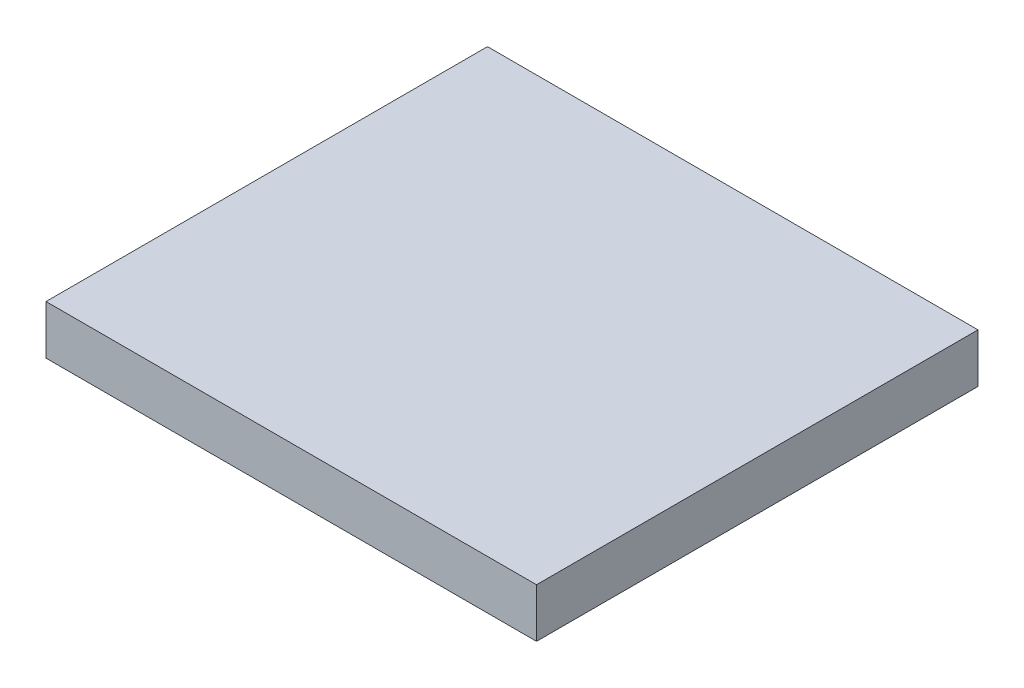
ISO-10303-21;
HEADER;
FILE_DESCRIPTION(('STEP AP214'),'2;1');
FILE_NAME('part.step','',(''),(''),'','','');
FILE_SCHEMA(('AUTOMOTIVE_DESIGN { 1 0 10303 214 1 1 1 1 }'));
ENDSEC;
DATA;
#1=APPLICATION_CONTEXT('core data for automotive mechanical design processes');
#2=APPLICATION_PROTOCOL_DEFINITION('international standard','automotive_design',2000,#1);
#3=PRODUCT_CONTEXT('',#1,'mechanical');
#4=PRODUCT('Part','Part','',(#3));
#5=PRODUCT_RELATED_PRODUCT_CATEGORY('part','',(#4));
#6=PRODUCT_DEFINITION_FORMATION('','',#4);
#7=PRODUCT_DEFINITION_CONTEXT('part definition',#1,'design');
#8=PRODUCT_DEFINITION('design','',#6,#7);
#9=PRODUCT_DEFINITION_SHAPE('','',#8);
#10=(LENGTH_UNIT() NAMED_UNIT(*) SI_UNIT(.MILLI.,.METRE.));
#11=(NAMED_UNIT(*) PLANE_ANGLE_UNIT() SI_UNIT($,.RADIAN.));
#12=(NAMED_UNIT(*) SI_UNIT($,.STERADIAN.) SOLID_ANGLE_UNIT());
#13=UNCERTAINTY_MEASURE_WITH_UNIT(LENGTH_MEASURE(1.E-05),#10,'distance_accuracy_value','');
#14=(GEOMETRIC_REPRESENTATION_CONTEXT(3) GLOBAL_UNCERTAINTY_ASSIGNED_CONTEXT((#13)) GLOBAL_UNIT_ASSIGNED_CONTEXT((#10,
#11,#12)) REPRESENTATION_CONTEXT('',''));
#15=CARTESIAN_POINT('',(0.,0.,0.));
#16=DIRECTION('',(0.,0.,1.));
#17=DIRECTION('',(1.,0.,0.));
#18=AXIS2_PLACEMENT_3D('',#15,#16,#17);
#19=CARTESIAN_POINT('',(50.,10.,-45.));
#20=DIRECTION('',(-1.,0.,0.));
#21=DIRECTION('',(0.,0.,1.));
#22=AXIS2_PLACEMENT_3D('',#19,#20,#21);
#23=PLANE('',#22);
#24=DIRECTION('',(0.,0.,-1.));
#25=VECTOR('',#24,1.);
#26=CARTESIAN_POINT('',(50.,0.,-45.));
#27=LINE('',#26,#25);
#28=CARTESIAN_POINT('',(50.,0.,45.));
#29=VERTEX_POINT('',#28);
#30=CARTESIAN_POINT('',(50.,0.,-45.));
#31=VERTEX_POINT('',#30);
#32=EDGE_CURVE('E107',#29,#31,#27,.T.);
#33=ORIENTED_EDGE('',*,*,#32,.T.);
#34=DIRECTION('',(0.,-1.,0.));
#35=VECTOR('',#34,1.);
#36=CARTESIAN_POINT('',(50.,10.,-45.));
#37=LINE('',#36,#35);
#38=CARTESIAN_POINT('',(50.,10.,-45.));
#39=VERTEX_POINT('',#38);
#40=EDGE_CURVE('E11',#39,#31,#37,.T.);
#41=ORIENTED_EDGE('',*,*,#40,.F.);
#42=DIRECTION('',(0.,0.,-1.));
#43=VECTOR('',#42,1.);
#44=CARTESIAN_POINT('',(50.,10.,-45.));
#45=LINE('',#44,#43);
#46=CARTESIAN_POINT('',(50.,10.,45.));
#47=VERTEX_POINT('',#46);
#48=EDGE_CURVE('E91',#47,#39,#45,.T.);
#49=ORIENTED_EDGE('',*,*,#48,.F.);
#50=DIRECTION('',(0.,-1.,0.));
#51=VECTOR('',#50,1.);
#52=CARTESIAN_POINT('',(50.,10.,45.));
#53=LINE('',#52,#51);
#54=EDGE_CURVE('E103',#47,#29,#53,.T.);
#55=ORIENTED_EDGE('',*,*,#54,.T.);
#56=EDGE_LOOP('',(#33,#41,#49,#55));
#57=FACE_BOUND('',#56,.T.);
#58=ADVANCED_FACE('F39',(#57),#23,.F.);
#59=CARTESIAN_POINT('',(-50.,10.,-45.));
#60=DIRECTION('',(0.,0.,1.));
#61=DIRECTION('',(1.,0.,0.));
#62=AXIS2_PLACEMENT_3D('',#59,#60,#61);
#63=PLANE('',#62);
#64=DIRECTION('',(-1.,0.,0.));
#65=VECTOR('',#64,1.);
#66=CARTESIAN_POINT('',(-50.,0.,-45.));
#67=LINE('',#66,#65);
#68=CARTESIAN_POINT('',(-50.,0.,-45.));
#69=VERTEX_POINT('',#68);
#70=EDGE_CURVE('E96',#31,#69,#67,.T.);
#71=ORIENTED_EDGE('',*,*,#70,.T.);
#72=DIRECTION('',(0.,-1.,0.));
#73=VECTOR('',#72,1.);
#74=CARTESIAN_POINT('',(-50.,10.,-45.));
#75=LINE('',#74,#73);
#76=CARTESIAN_POINT('',(-50.,10.,-45.));
#77=VERTEX_POINT('',#76);
#78=EDGE_CURVE('E48',#77,#69,#75,.T.);
#79=ORIENTED_EDGE('',*,*,#78,.F.);
#80=DIRECTION('',(-1.,0.,0.));
#81=VECTOR('',#80,1.);
#82=CARTESIAN_POINT('',(-50.,10.,-45.));
#83=LINE('',#82,#81);
#84=EDGE_CURVE('E86',#39,#77,#83,.T.);
#85=ORIENTED_EDGE('',*,*,#84,.F.);
#86=ORIENTED_EDGE('',*,*,#40,.T.);
#87=EDGE_LOOP('',(#71,#79,#85,#86));
#88=FACE_BOUND('',#87,.T.);
#89=ADVANCED_FACE('F95',(#88),#63,.F.);
#90=CARTESIAN_POINT('',(-50.,10.,-45.));
#91=DIRECTION('',(1.,0.,0.));
#92=DIRECTION('',(0.,0.,-1.));
#93=AXIS2_PLACEMENT_3D('',#90,#91,#92);
#94=PLANE('',#93);
#95=DIRECTION('',(0.,0.,1.));
#96=VECTOR('',#95,1.);
#97=CARTESIAN_POINT('',(-50.,0.,-45.));
#98=LINE('',#97,#96);
#99=CARTESIAN_POINT('',(-50.,0.,45.));
#100=VERTEX_POINT('',#99);
#101=EDGE_CURVE('E73',#69,#100,#98,.T.);
#102=ORIENTED_EDGE('',*,*,#101,.T.);
#103=DIRECTION('',(0.,-1.,0.));
#104=VECTOR('',#103,1.);
#105=CARTESIAN_POINT('',(-50.,10.,45.));
#106=LINE('',#105,#104);
#107=CARTESIAN_POINT('',(-50.,10.,45.));
#108=VERTEX_POINT('',#107);
#109=EDGE_CURVE('E98',#108,#100,#106,.T.);
#110=ORIENTED_EDGE('',*,*,#109,.F.);
#111=DIRECTION('',(0.,0.,1.));
#112=VECTOR('',#111,1.);
#113=CARTESIAN_POINT('',(-50.,10.,-45.));
#114=LINE('',#113,#112);
#115=EDGE_CURVE('E89',#77,#108,#114,.T.);
#116=ORIENTED_EDGE('',*,*,#115,.F.);
#117=ORIENTED_EDGE('',*,*,#78,.T.);
#118=EDGE_LOOP('',(#102,#110,#116,#117));
#119=FACE_BOUND('',#118,.T.);
#120=ADVANCED_FACE('F99',(#119),#94,.F.);
#121=CARTESIAN_POINT('',(-50.,10.,45.));
#122=DIRECTION('',(0.,0.,-1.));
#123=DIRECTION('',(-1.,0.,0.));
#124=AXIS2_PLACEMENT_3D('',#121,#122,#123);
#125=PLANE('',#124);
#126=DIRECTION('',(1.,0.,0.));
#127=VECTOR('',#126,1.);
#128=CARTESIAN_POINT('',(-50.,0.,45.));
#129=LINE('',#128,#127);
#130=EDGE_CURVE('E79',#100,#29,#129,.T.);
#131=ORIENTED_EDGE('',*,*,#130,.T.);
#132=ORIENTED_EDGE('',*,*,#54,.F.);
#133=DIRECTION('',(1.,0.,0.));
#134=VECTOR('',#133,1.);
#135=CARTESIAN_POINT('',(-50.,10.,45.));
#136=LINE('',#135,#134);
#137=EDGE_CURVE('E56',#108,#47,#136,.T.);
#138=ORIENTED_EDGE('',*,*,#137,.F.);
#139=ORIENTED_EDGE('',*,*,#109,.T.);
#140=EDGE_LOOP('',(#131,#132,#138,#139));
#141=FACE_BOUND('',#140,.T.);
#142=ADVANCED_FACE('F120',(#141),#125,.F.);
#143=CARTESIAN_POINT('',(0.,10.,0.));
#144=DIRECTION('',(0.,1.,0.));
#145=DIRECTION('',(0.,0.,1.));
#146=AXIS2_PLACEMENT_3D('',#143,#144,#145);
#147=PLANE('',#146);
#148=ORIENTED_EDGE('',*,*,#48,.T.);
#149=ORIENTED_EDGE('',*,*,#84,.T.);
#150=ORIENTED_EDGE('',*,*,#115,.T.);
#151=ORIENTED_EDGE('',*,*,#137,.T.);
#152=EDGE_LOOP('',(#148,#149,#150,#151));
#153=FACE_BOUND('',#152,.T.);
#154=ADVANCED_FACE('F87',(#153),#147,.T.);
#155=CARTESIAN_POINT('',(0.,0.,0.));
#156=DIRECTION('',(0.,1.,0.));
#157=DIRECTION('',(0.,0.,1.));
#158=AXIS2_PLACEMENT_3D('',#155,#156,#157);
#159=PLANE('',#158);
#160=ORIENTED_EDGE('',*,*,#32,.F.);
#161=ORIENTED_EDGE('',*,*,#130,.F.);
#162=ORIENTED_EDGE('',*,*,#101,.F.);
#163=ORIENTED_EDGE('',*,*,#70,.F.);
#164=EDGE_LOOP('',(#160,#161,#162,#163));
#165=FACE_BOUND('',#164,.T.);
#166=ADVANCED_FACE('F123',(#165),#159,.F.);
#167=CLOSED_SHELL('',(#58,#89,#120,#142,#154,#166));
#168=MANIFOLD_SOLID_BREP('B2',#167);
#169=ADVANCED_BREP_SHAPE_REPRESENTATION('',(#18,#168),#14);
#170=SHAPE_DEFINITION_REPRESENTATION(#9,#169);
ENDSEC;
END-ISO-10303-21;
